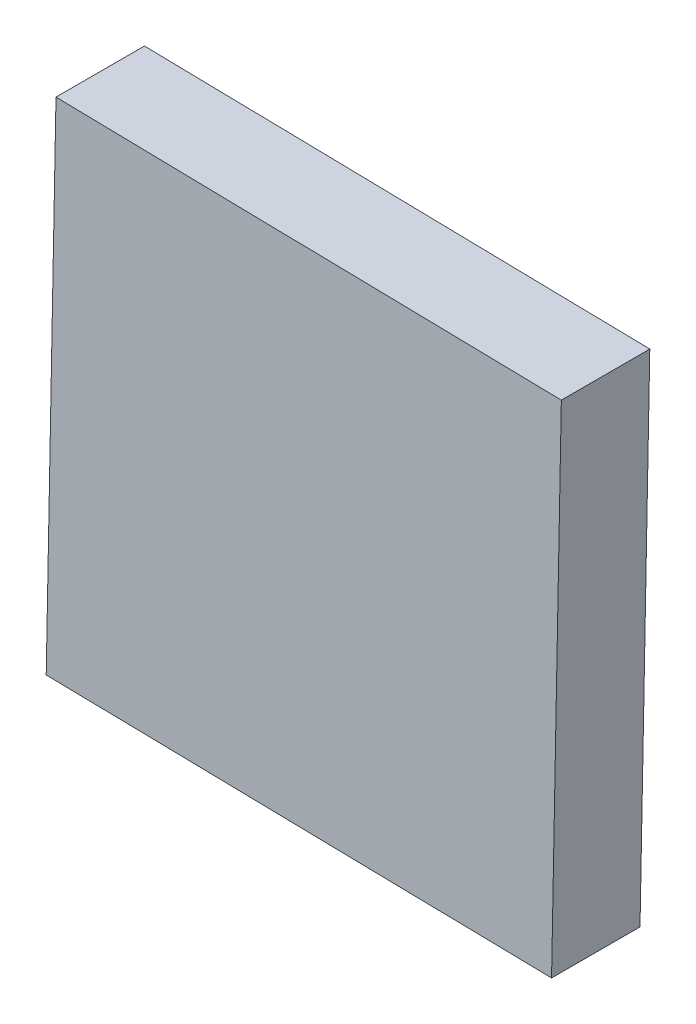
ISO-10303-21;
HEADER;
FILE_DESCRIPTION(('STEP AP214'),'2;1');
FILE_NAME('part.step','',(''),(''),'','','');
FILE_SCHEMA(('AUTOMOTIVE_DESIGN { 1 0 10303 214 1 1 1 1 }'));
ENDSEC;
DATA;
#1=APPLICATION_CONTEXT('core data for automotive mechanical design processes');
#2=APPLICATION_PROTOCOL_DEFINITION('international standard','automotive_design',2000,#1);
#3=PRODUCT_CONTEXT('',#1,'mechanical');
#4=PRODUCT('Part','Part','',(#3));
#5=PRODUCT_RELATED_PRODUCT_CATEGORY('part','',(#4));
#6=PRODUCT_DEFINITION_FORMATION('','',#4);
#7=PRODUCT_DEFINITION_CONTEXT('part definition',#1,'design');
#8=PRODUCT_DEFINITION('design','',#6,#7);
#9=PRODUCT_DEFINITION_SHAPE('','',#8);
#10=(LENGTH_UNIT() NAMED_UNIT(*) SI_UNIT(.MILLI.,.METRE.));
#11=(NAMED_UNIT(*) PLANE_ANGLE_UNIT() SI_UNIT($,.RADIAN.));
#12=(NAMED_UNIT(*) SI_UNIT($,.STERADIAN.) SOLID_ANGLE_UNIT());
#13=UNCERTAINTY_MEASURE_WITH_UNIT(LENGTH_MEASURE(1.E-05),#10,'distance_accuracy_value','');
#14=(GEOMETRIC_REPRESENTATION_CONTEXT(3) GLOBAL_UNCERTAINTY_ASSIGNED_CONTEXT((#13)) GLOBAL_UNIT_ASSIGNED_CONTEXT((#10,
#11,#12)) REPRESENTATION_CONTEXT('',''));
#15=CARTESIAN_POINT('',(0.,0.,0.));
#16=DIRECTION('',(0.,0.,1.));
#17=DIRECTION('',(1.,0.,0.));
#18=AXIS2_PLACEMENT_3D('',#15,#16,#17);
#19=CARTESIAN_POINT('',(-1.71244910615213,0.776448251307159,41.1510965279299));
#20=DIRECTION('',(0.,0.,1.));
#21=DIRECTION('',(0.999812677663925,-0.0193548335692301,0.));
#22=AXIS2_PLACEMENT_3D('',#19,#20,#21);
#23=PLANE('',#22);
#24=DIRECTION('',(0.0193548335692301,0.999812677663925,0.));
#25=VECTOR('',#24,1.);
#26=CARTESIAN_POINT('',(-4.30113458468434,-1.71391467269336,41.1510965279298));
#27=LINE('',#26,#25);
#28=CARTESIAN_POINT('',(-4.30113458468434,-1.71391467269336,41.1510965279298));
#29=VERTEX_POINT('',#28);
#30=CARTESIAN_POINT('',(-4.20281203015266,3.36513372983937,41.1510965279297));
#31=VERTEX_POINT('',#30);
#32=EDGE_CURVE('E58',#29,#31,#27,.T.);
#33=ORIENTED_EDGE('',*,*,#32,.T.);
#34=DIRECTION('',(0.999812677663925,-0.0193548335692299,0.));
#35=VECTOR('',#34,1.);
#36=CARTESIAN_POINT('',(-4.20281203015266,3.36513372983937,41.1510965279297));
#37=LINE('',#36,#35);
#38=CARTESIAN_POINT('',(0.876236372380084,3.26681117530768,41.1510965279299));
#39=VERTEX_POINT('',#38);
#40=EDGE_CURVE('E20',#31,#39,#37,.T.);
#41=ORIENTED_EDGE('',*,*,#40,.T.);
#42=DIRECTION('',(-0.0193548335692301,-0.999812677663925,0.));
#43=VECTOR('',#42,1.);
#44=CARTESIAN_POINT('',(0.777913817848395,-1.81223722722505,41.15109652793));
#45=LINE('',#44,#43);
#46=CARTESIAN_POINT('',(0.777913817848395,-1.81223722722505,41.15109652793));
#47=VERTEX_POINT('',#46);
#48=EDGE_CURVE('E90',#39,#47,#45,.T.);
#49=ORIENTED_EDGE('',*,*,#48,.T.);
#50=DIRECTION('',(-0.999812677663925,0.0193548335692299,0.));
#51=VECTOR('',#50,1.);
#52=CARTESIAN_POINT('',(-4.30113458468434,-1.71391467269336,41.1510965279298));
#53=LINE('',#52,#51);
#54=EDGE_CURVE('E56',#47,#29,#53,.T.);
#55=ORIENTED_EDGE('',*,*,#54,.T.);
#56=EDGE_LOOP('',(#33,#41,#49,#55));
#57=FACE_BOUND('',#56,.T.);
#58=ADVANCED_FACE('F17',(#57),#23,.F.);
#59=CARTESIAN_POINT('',(-4.20281203015269,3.36513372983939,42.0400965279297));
#60=DIRECTION('',(-0.0193548335692299,-0.999812677663925,0.));
#61=DIRECTION('',(0.999812677663925,-0.0193548335692299,0.));
#62=AXIS2_PLACEMENT_3D('',#59,#60,#61);
#63=PLANE('',#62);
#64=DIRECTION('',(0.,0.,1.));
#65=VECTOR('',#64,1.);
#66=CARTESIAN_POINT('',(0.876236372380056,3.2668111753077,42.0400965279299));
#67=LINE('',#66,#65);
#68=CARTESIAN_POINT('',(0.876236372380056,3.2668111753077,42.0400965279299));
#69=VERTEX_POINT('',#68);
#70=EDGE_CURVE('E70',#69,#39,#67,.F.);
#71=ORIENTED_EDGE('',*,*,#70,.T.);
#72=ORIENTED_EDGE('',*,*,#40,.F.);
#73=DIRECTION('',(0.,0.,1.));
#74=VECTOR('',#73,1.);
#75=CARTESIAN_POINT('',(-4.20281203015269,3.36513372983939,42.0400965279297));
#76=LINE('',#75,#74);
#77=CARTESIAN_POINT('',(-4.20281203015269,3.36513372983939,42.0400965279297));
#78=VERTEX_POINT('',#77);
#79=EDGE_CURVE('E65',#31,#78,#76,.T.);
#80=ORIENTED_EDGE('',*,*,#79,.T.);
#81=DIRECTION('',(0.999812677663925,-0.0193548335692301,0.));
#82=VECTOR('',#81,1.);
#83=CARTESIAN_POINT('',(-1.66328782888631,3.31597245257354,42.0400965279299));
#84=LINE('',#83,#82);
#85=EDGE_CURVE('E94',#69,#78,#84,.F.);
#86=ORIENTED_EDGE('',*,*,#85,.F.);
#87=EDGE_LOOP('',(#71,#72,#80,#86));
#88=FACE_BOUND('',#87,.T.);
#89=ADVANCED_FACE('F67',(#88),#63,.F.);
#90=CARTESIAN_POINT('',(-4.30113458468437,-1.71391467269335,42.0400965279298));
#91=DIRECTION('',(0.999812677663925,-0.0193548335692301,0.));
#92=DIRECTION('',(0.0193548335692301,0.999812677663925,0.));
#93=AXIS2_PLACEMENT_3D('',#90,#91,#92);
#94=PLANE('',#93);
#95=ORIENTED_EDGE('',*,*,#79,.F.);
#96=ORIENTED_EDGE('',*,*,#32,.F.);
#97=DIRECTION('',(0.,0.,1.));
#98=VECTOR('',#97,1.);
#99=CARTESIAN_POINT('',(-4.30113458468437,-1.71391467269335,42.0400965279298));
#100=LINE('',#99,#98);
#101=CARTESIAN_POINT('',(-4.30113458468437,-1.71391467269335,42.0400965279298));
#102=VERTEX_POINT('',#101);
#103=EDGE_CURVE('E83',#29,#102,#100,.T.);
#104=ORIENTED_EDGE('',*,*,#103,.T.);
#105=DIRECTION('',(0.0193548335692301,0.999812677663925,0.));
#106=VECTOR('',#105,1.);
#107=CARTESIAN_POINT('',(-4.25197330741853,0.825609528573017,42.0400965279298));
#108=LINE('',#107,#106);
#109=EDGE_CURVE('E75',#78,#102,#108,.F.);
#110=ORIENTED_EDGE('',*,*,#109,.F.);
#111=EDGE_LOOP('',(#95,#96,#104,#110));
#112=FACE_BOUND('',#111,.T.);
#113=ADVANCED_FACE('F73',(#112),#94,.F.);
#114=CARTESIAN_POINT('',(-4.30113458468437,-1.71391467269335,42.0400965279298));
#115=DIRECTION('',(0.0193548335692299,0.999812677663925,0.));
#116=DIRECTION('',(-0.999812677663925,0.0193548335692299,0.));
#117=AXIS2_PLACEMENT_3D('',#114,#115,#116);
#118=PLANE('',#117);
#119=ORIENTED_EDGE('',*,*,#103,.F.);
#120=ORIENTED_EDGE('',*,*,#54,.F.);
#121=DIRECTION('',(0.,0.,1.));
#122=VECTOR('',#121,1.);
#123=CARTESIAN_POINT('',(0.777913817848367,-1.81223722722504,42.04009652793));
#124=LINE('',#123,#122);
#125=CARTESIAN_POINT('',(0.777913817848367,-1.81223722722504,42.04009652793));
#126=VERTEX_POINT('',#125);
#127=EDGE_CURVE('E36',#47,#126,#124,.T.);
#128=ORIENTED_EDGE('',*,*,#127,.T.);
#129=DIRECTION('',(0.999812677663925,-0.0193548335692301,0.));
#130=VECTOR('',#129,1.);
#131=CARTESIAN_POINT('',(-1.76161038341801,-1.76307594995919,42.0400965279299));
#132=LINE('',#131,#130);
#133=EDGE_CURVE('E27',#102,#126,#132,.T.);
#134=ORIENTED_EDGE('',*,*,#133,.F.);
#135=EDGE_LOOP('',(#119,#120,#128,#134));
#136=FACE_BOUND('',#135,.T.);
#137=ADVANCED_FACE('F102',(#136),#118,.F.);
#138=CARTESIAN_POINT('',(0.777913817848367,-1.81223722722504,42.04009652793));
#139=DIRECTION('',(-0.999812677663925,0.0193548335692301,0.));
#140=DIRECTION('',(-0.0193548335692301,-0.999812677663925,0.));
#141=AXIS2_PLACEMENT_3D('',#138,#139,#140);
#142=PLANE('',#141);
#143=ORIENTED_EDGE('',*,*,#127,.F.);
#144=ORIENTED_EDGE('',*,*,#48,.F.);
#145=ORIENTED_EDGE('',*,*,#70,.F.);
#146=DIRECTION('',(0.0193548335692301,0.999812677663925,0.));
#147=VECTOR('',#146,1.);
#148=CARTESIAN_POINT('',(0.827075095114211,0.727286974041328,42.0400965279299));
#149=LINE('',#148,#147);
#150=EDGE_CURVE('E11',#126,#69,#149,.T.);
#151=ORIENTED_EDGE('',*,*,#150,.F.);
#152=EDGE_LOOP('',(#143,#144,#145,#151));
#153=FACE_BOUND('',#152,.T.);
#154=ADVANCED_FACE('F104',(#153),#142,.F.);
#155=CARTESIAN_POINT('',(-1.71244910615216,0.776448251307172,42.0400965279299));
#156=DIRECTION('',(0.,0.,1.));
#157=DIRECTION('',(0.999812677663925,-0.0193548335692301,0.));
#158=AXIS2_PLACEMENT_3D('',#155,#156,#157);
#159=PLANE('',#158);
#160=ORIENTED_EDGE('',*,*,#133,.T.);
#161=ORIENTED_EDGE('',*,*,#150,.T.);
#162=ORIENTED_EDGE('',*,*,#85,.T.);
#163=ORIENTED_EDGE('',*,*,#109,.T.);
#164=EDGE_LOOP('',(#160,#161,#162,#163));
#165=FACE_BOUND('',#164,.T.);
#166=ADVANCED_FACE('F101',(#165),#159,.T.);
#167=CLOSED_SHELL('',(#58,#89,#113,#137,#154,#166));
#168=MANIFOLD_SOLID_BREP('B1',#167);
#169=ADVANCED_BREP_SHAPE_REPRESENTATION('',(#18,#168),#14);
#170=SHAPE_DEFINITION_REPRESENTATION(#9,#169);
ENDSEC;
END-ISO-10303-21;
